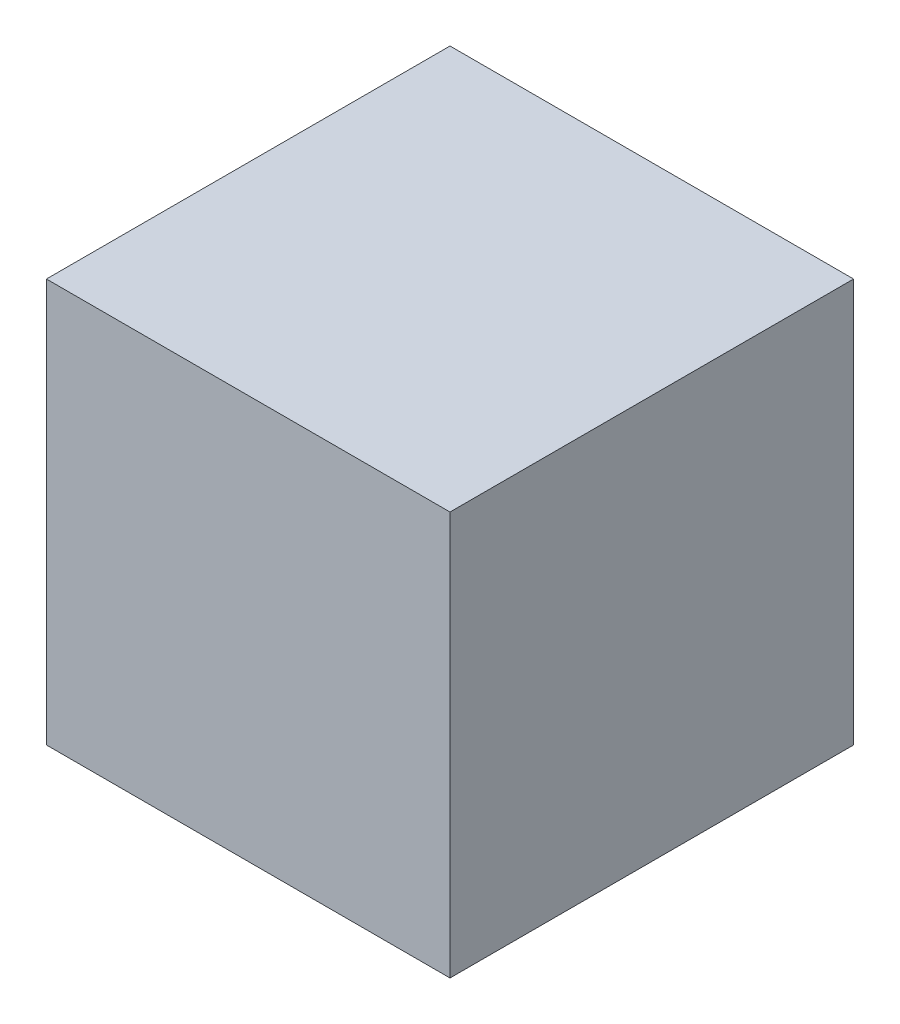
ISO-10303-21;
HEADER;
FILE_DESCRIPTION(('STEP AP214'),'2;1');
FILE_NAME('part.step','',(''),(''),'','','');
FILE_SCHEMA(('AUTOMOTIVE_DESIGN { 1 0 10303 214 1 1 1 1 }'));
ENDSEC;
DATA;
#1=APPLICATION_CONTEXT('core data for automotive mechanical design processes');
#2=APPLICATION_PROTOCOL_DEFINITION('international standard','automotive_design',2000,#1);
#3=PRODUCT_CONTEXT('',#1,'mechanical');
#4=PRODUCT('Part','Part','',(#3));
#5=PRODUCT_RELATED_PRODUCT_CATEGORY('part','',(#4));
#6=PRODUCT_DEFINITION_FORMATION('','',#4);
#7=PRODUCT_DEFINITION_CONTEXT('part definition',#1,'design');
#8=PRODUCT_DEFINITION('design','',#6,#7);
#9=PRODUCT_DEFINITION_SHAPE('','',#8);
#10=(LENGTH_UNIT() NAMED_UNIT(*) SI_UNIT(.MILLI.,.METRE.));
#11=(NAMED_UNIT(*) PLANE_ANGLE_UNIT() SI_UNIT($,.RADIAN.));
#12=(NAMED_UNIT(*) SI_UNIT($,.STERADIAN.) SOLID_ANGLE_UNIT());
#13=UNCERTAINTY_MEASURE_WITH_UNIT(LENGTH_MEASURE(1.E-05),#10,'distance_accuracy_value','');
#14=(GEOMETRIC_REPRESENTATION_CONTEXT(3) GLOBAL_UNCERTAINTY_ASSIGNED_CONTEXT((#13)) GLOBAL_UNIT_ASSIGNED_CONTEXT((#10,
#11,#12)) REPRESENTATION_CONTEXT('',''));
#15=CARTESIAN_POINT('',(0.,0.,0.));
#16=DIRECTION('',(0.,0.,1.));
#17=DIRECTION('',(1.,0.,0.));
#18=AXIS2_PLACEMENT_3D('',#15,#16,#17);
#19=CARTESIAN_POINT('',(75.,150.,-75.));
#20=DIRECTION('',(-1.,0.,0.));
#21=DIRECTION('',(0.,0.,1.));
#22=AXIS2_PLACEMENT_3D('',#19,#20,#21);
#23=PLANE('',#22);
#24=DIRECTION('',(0.,0.,-1.));
#25=VECTOR('',#24,1.);
#26=CARTESIAN_POINT('',(75.,0.,-75.));
#27=LINE('',#26,#25);
#28=CARTESIAN_POINT('',(75.,0.,75.));
#29=VERTEX_POINT('',#28);
#30=CARTESIAN_POINT('',(75.,0.,-75.));
#31=VERTEX_POINT('',#30);
#32=EDGE_CURVE('E100',#29,#31,#27,.T.);
#33=ORIENTED_EDGE('',*,*,#32,.T.);
#34=DIRECTION('',(0.,-1.,0.));
#35=VECTOR('',#34,1.);
#36=CARTESIAN_POINT('',(75.,150.,-75.));
#37=LINE('',#36,#35);
#38=CARTESIAN_POINT('',(75.,150.,-75.));
#39=VERTEX_POINT('',#38);
#40=EDGE_CURVE('E11',#39,#31,#37,.T.);
#41=ORIENTED_EDGE('',*,*,#40,.F.);
#42=DIRECTION('',(0.,0.,-1.));
#43=VECTOR('',#42,1.);
#44=CARTESIAN_POINT('',(75.,150.,-75.));
#45=LINE('',#44,#43);
#46=CARTESIAN_POINT('',(75.,150.,75.));
#47=VERTEX_POINT('',#46);
#48=EDGE_CURVE('E88',#47,#39,#45,.T.);
#49=ORIENTED_EDGE('',*,*,#48,.F.);
#50=DIRECTION('',(0.,-1.,0.));
#51=VECTOR('',#50,1.);
#52=CARTESIAN_POINT('',(75.,150.,75.));
#53=LINE('',#52,#51);
#54=EDGE_CURVE('E96',#47,#29,#53,.T.);
#55=ORIENTED_EDGE('',*,*,#54,.T.);
#56=EDGE_LOOP('',(#33,#41,#49,#55));
#57=FACE_BOUND('',#56,.T.);
#58=ADVANCED_FACE('F37',(#57),#23,.F.);
#59=CARTESIAN_POINT('',(-75.,150.,-75.));
#60=DIRECTION('',(0.,0.,1.));
#61=DIRECTION('',(1.,0.,0.));
#62=AXIS2_PLACEMENT_3D('',#59,#60,#61);
#63=PLANE('',#62);
#64=DIRECTION('',(-1.,0.,0.));
#65=VECTOR('',#64,1.);
#66=CARTESIAN_POINT('',(-75.,0.,-75.));
#67=LINE('',#66,#65);
#68=CARTESIAN_POINT('',(-75.,0.,-75.));
#69=VERTEX_POINT('',#68);
#70=EDGE_CURVE('E92',#31,#69,#67,.T.);
#71=ORIENTED_EDGE('',*,*,#70,.T.);
#72=DIRECTION('',(0.,-1.,0.));
#73=VECTOR('',#72,1.);
#74=CARTESIAN_POINT('',(-75.,150.,-75.));
#75=LINE('',#74,#73);
#76=CARTESIAN_POINT('',(-75.,150.,-75.));
#77=VERTEX_POINT('',#76);
#78=EDGE_CURVE('E45',#77,#69,#75,.T.);
#79=ORIENTED_EDGE('',*,*,#78,.F.);
#80=DIRECTION('',(-1.,0.,0.));
#81=VECTOR('',#80,1.);
#82=CARTESIAN_POINT('',(-75.,150.,-75.));
#83=LINE('',#82,#81);
#84=EDGE_CURVE('E83',#39,#77,#83,.T.);
#85=ORIENTED_EDGE('',*,*,#84,.F.);
#86=ORIENTED_EDGE('',*,*,#40,.T.);
#87=EDGE_LOOP('',(#71,#79,#85,#86));
#88=FACE_BOUND('',#87,.T.);
#89=ADVANCED_FACE('F91',(#88),#63,.F.);
#90=CARTESIAN_POINT('',(-75.,150.,-75.));
#91=DIRECTION('',(1.,0.,0.));
#92=DIRECTION('',(0.,0.,-1.));
#93=AXIS2_PLACEMENT_3D('',#90,#91,#92);
#94=PLANE('',#93);
#95=DIRECTION('',(0.,0.,1.));
#96=VECTOR('',#95,1.);
#97=CARTESIAN_POINT('',(-75.,0.,-75.));
#98=LINE('',#97,#96);
#99=CARTESIAN_POINT('',(-75.,0.,75.));
#100=VERTEX_POINT('',#99);
#101=EDGE_CURVE('E70',#69,#100,#98,.T.);
#102=ORIENTED_EDGE('',*,*,#101,.T.);
#103=DIRECTION('',(0.,-1.,0.));
#104=VECTOR('',#103,1.);
#105=CARTESIAN_POINT('',(-75.,150.,75.));
#106=LINE('',#105,#104);
#107=CARTESIAN_POINT('',(-75.,150.,75.));
#108=VERTEX_POINT('',#107);
#109=EDGE_CURVE('E93',#108,#100,#106,.T.);
#110=ORIENTED_EDGE('',*,*,#109,.F.);
#111=DIRECTION('',(0.,0.,1.));
#112=VECTOR('',#111,1.);
#113=CARTESIAN_POINT('',(-75.,150.,-75.));
#114=LINE('',#113,#112);
#115=EDGE_CURVE('E86',#77,#108,#114,.T.);
#116=ORIENTED_EDGE('',*,*,#115,.F.);
#117=ORIENTED_EDGE('',*,*,#78,.T.);
#118=EDGE_LOOP('',(#102,#110,#116,#117));
#119=FACE_BOUND('',#118,.T.);
#120=ADVANCED_FACE('F94',(#119),#94,.F.);
#121=CARTESIAN_POINT('',(-75.,150.,75.));
#122=DIRECTION('',(0.,0.,-1.));
#123=DIRECTION('',(-1.,0.,0.));
#124=AXIS2_PLACEMENT_3D('',#121,#122,#123);
#125=PLANE('',#124);
#126=DIRECTION('',(1.,0.,0.));
#127=VECTOR('',#126,1.);
#128=CARTESIAN_POINT('',(-75.,0.,75.));
#129=LINE('',#128,#127);
#130=EDGE_CURVE('E76',#100,#29,#129,.T.);
#131=ORIENTED_EDGE('',*,*,#130,.T.);
#132=ORIENTED_EDGE('',*,*,#54,.F.);
#133=DIRECTION('',(1.,0.,0.));
#134=VECTOR('',#133,1.);
#135=CARTESIAN_POINT('',(-75.,150.,75.));
#136=LINE('',#135,#134);
#137=EDGE_CURVE('E53',#108,#47,#136,.T.);
#138=ORIENTED_EDGE('',*,*,#137,.F.);
#139=ORIENTED_EDGE('',*,*,#109,.T.);
#140=EDGE_LOOP('',(#131,#132,#138,#139));
#141=FACE_BOUND('',#140,.T.);
#142=ADVANCED_FACE('F107',(#141),#125,.F.);
#143=CARTESIAN_POINT('',(0.,150.,0.));
#144=DIRECTION('',(0.,1.,0.));
#145=DIRECTION('',(0.,0.,1.));
#146=AXIS2_PLACEMENT_3D('',#143,#144,#145);
#147=PLANE('',#146);
#148=ORIENTED_EDGE('',*,*,#48,.T.);
#149=ORIENTED_EDGE('',*,*,#84,.T.);
#150=ORIENTED_EDGE('',*,*,#115,.T.);
#151=ORIENTED_EDGE('',*,*,#137,.T.);
#152=EDGE_LOOP('',(#148,#149,#150,#151));
#153=FACE_BOUND('',#152,.T.);
#154=ADVANCED_FACE('F84',(#153),#147,.T.);
#155=CARTESIAN_POINT('',(0.,0.,0.));
#156=DIRECTION('',(0.,1.,0.));
#157=DIRECTION('',(0.,0.,1.));
#158=AXIS2_PLACEMENT_3D('',#155,#156,#157);
#159=PLANE('',#158);
#160=ORIENTED_EDGE('',*,*,#32,.F.);
#161=ORIENTED_EDGE('',*,*,#130,.F.);
#162=ORIENTED_EDGE('',*,*,#101,.F.);
#163=ORIENTED_EDGE('',*,*,#70,.F.);
#164=EDGE_LOOP('',(#160,#161,#162,#163));
#165=FACE_BOUND('',#164,.T.);
#166=ADVANCED_FACE('F110',(#165),#159,.F.);
#167=CLOSED_SHELL('',(#58,#89,#120,#142,#154,#166));
#168=MANIFOLD_SOLID_BREP('B2',#167);
#169=ADVANCED_BREP_SHAPE_REPRESENTATION('',(#18,#168),#14);
#170=SHAPE_DEFINITION_REPRESENTATION(#9,#169);
ENDSEC;
END-ISO-10303-21;
